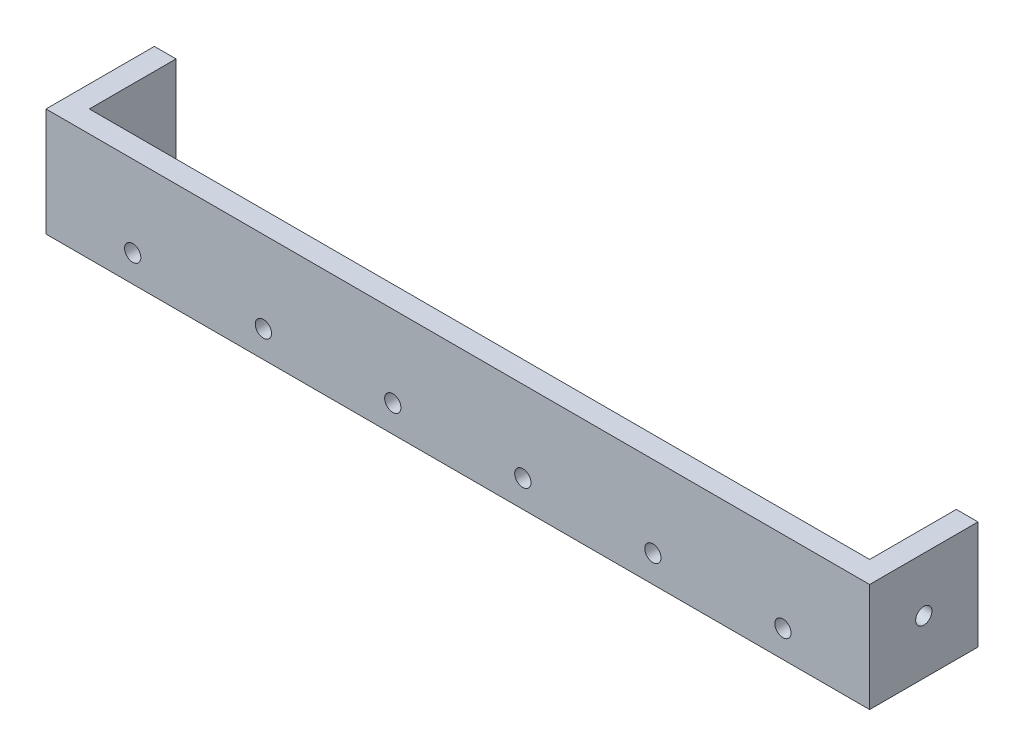
ISO-10303-21;
HEADER;
FILE_DESCRIPTION(('STEP AP214'),'2;1');
FILE_NAME('part.step','',(''),(''),'','','');
FILE_SCHEMA(('AUTOMOTIVE_DESIGN { 1 0 10303 214 1 1 1 1 }'));
ENDSEC;
DATA;
#1=APPLICATION_CONTEXT('core data for automotive mechanical design processes');
#2=APPLICATION_PROTOCOL_DEFINITION('international standard','automotive_design',2000,#1);
#3=PRODUCT_CONTEXT('',#1,'mechanical');
#4=PRODUCT('Part','Part','',(#3));
#5=PRODUCT_RELATED_PRODUCT_CATEGORY('part','',(#4));
#6=PRODUCT_DEFINITION_FORMATION('','',#4);
#7=PRODUCT_DEFINITION_CONTEXT('part definition',#1,'design');
#8=PRODUCT_DEFINITION('design','',#6,#7);
#9=PRODUCT_DEFINITION_SHAPE('','',#8);
#10=(LENGTH_UNIT() NAMED_UNIT(*) SI_UNIT(.MILLI.,.METRE.));
#11=(NAMED_UNIT(*) PLANE_ANGLE_UNIT() SI_UNIT($,.RADIAN.));
#12=(NAMED_UNIT(*) SI_UNIT($,.STERADIAN.) SOLID_ANGLE_UNIT());
#13=UNCERTAINTY_MEASURE_WITH_UNIT(LENGTH_MEASURE(1.E-05),#10,'distance_accuracy_value','');
#14=(GEOMETRIC_REPRESENTATION_CONTEXT(3) GLOBAL_UNCERTAINTY_ASSIGNED_CONTEXT((#13)) GLOBAL_UNIT_ASSIGNED_CONTEXT((#10,
#11,#12)) REPRESENTATION_CONTEXT('',''));
#15=CARTESIAN_POINT('',(0.,0.,0.));
#16=DIRECTION('',(0.,0.,1.));
#17=DIRECTION('',(1.,0.,0.));
#18=AXIS2_PLACEMENT_3D('',#15,#16,#17);
#19=CARTESIAN_POINT('',(0.,0.,2.));
#20=DIRECTION('',(0.,1.,0.));
#21=DIRECTION('',(0.,0.,1.));
#22=AXIS2_PLACEMENT_3D('',#19,#20,#21);
#23=PLANE('',#22);
#24=DIRECTION('',(1.,0.,0.));
#25=VECTOR('',#24,1.);
#26=CARTESIAN_POINT('',(0.,0.,0.));
#27=LINE('',#26,#25);
#28=CARTESIAN_POINT('',(0.,0.,0.));
#29=VERTEX_POINT('',#28);
#30=CARTESIAN_POINT('',(72.,0.,0.));
#31=VERTEX_POINT('',#30);
#32=EDGE_CURVE('E60',#29,#31,#27,.T.);
#33=ORIENTED_EDGE('',*,*,#32,.T.);
#34=DIRECTION('',(0.,0.,-1.));
#35=VECTOR('',#34,1.);
#36=CARTESIAN_POINT('',(72.,0.,2.));
#37=LINE('',#36,#35);
#38=CARTESIAN_POINT('',(72.,0.,-8.));
#39=VERTEX_POINT('',#38);
#40=EDGE_CURVE('E144',#31,#39,#37,.T.);
#41=ORIENTED_EDGE('',*,*,#40,.T.);
#42=DIRECTION('',(-1.,0.,0.));
#43=VECTOR('',#42,1.);
#44=CARTESIAN_POINT('',(74.,0.,-8.));
#45=LINE('',#44,#43);
#46=CARTESIAN_POINT('',(74.,0.,-8.));
#47=VERTEX_POINT('',#46);
#48=EDGE_CURVE('E162',#47,#39,#45,.T.);
#49=ORIENTED_EDGE('',*,*,#48,.F.);
#50=DIRECTION('',(0.,0.,-1.));
#51=VECTOR('',#50,1.);
#52=CARTESIAN_POINT('',(74.,0.,2.));
#53=LINE('',#52,#51);
#54=CARTESIAN_POINT('',(74.,0.,2.));
#55=VERTEX_POINT('',#54);
#56=EDGE_CURVE('E148',#55,#47,#53,.T.);
#57=ORIENTED_EDGE('',*,*,#56,.F.);
#58=DIRECTION('',(1.,0.,0.));
#59=VECTOR('',#58,1.);
#60=CARTESIAN_POINT('',(0.,0.,2.));
#61=LINE('',#60,#59);
#62=CARTESIAN_POINT('',(-2.,0.,2.));
#63=VERTEX_POINT('',#62);
#64=EDGE_CURVE('E45',#63,#55,#61,.T.);
#65=ORIENTED_EDGE('',*,*,#64,.F.);
#66=DIRECTION('',(0.,0.,1.));
#67=VECTOR('',#66,1.);
#68=CARTESIAN_POINT('',(-2.,0.,2.));
#69=LINE('',#68,#67);
#70=CARTESIAN_POINT('',(-2.,0.,-8.));
#71=VERTEX_POINT('',#70);
#72=EDGE_CURVE('E121',#71,#63,#69,.T.);
#73=ORIENTED_EDGE('',*,*,#72,.F.);
#74=DIRECTION('',(1.,0.,0.));
#75=VECTOR('',#74,1.);
#76=CARTESIAN_POINT('',(-2.,0.,-8.));
#77=LINE('',#76,#75);
#78=CARTESIAN_POINT('',(0.,0.,-8.));
#79=VERTEX_POINT('',#78);
#80=EDGE_CURVE('E132',#71,#79,#77,.T.);
#81=ORIENTED_EDGE('',*,*,#80,.T.);
#82=DIRECTION('',(0.,0.,1.));
#83=VECTOR('',#82,1.);
#84=CARTESIAN_POINT('',(0.,0.,2.));
#85=LINE('',#84,#83);
#86=EDGE_CURVE('E122',#79,#29,#85,.T.);
#87=ORIENTED_EDGE('',*,*,#86,.T.);
#88=EDGE_LOOP('',(#33,#41,#49,#57,#65,#73,#81,#87));
#89=FACE_BOUND('',#88,.T.);
#90=ADVANCED_FACE('F37',(#89),#23,.F.);
#91=CARTESIAN_POINT('',(0.,10.,2.));
#92=DIRECTION('',(0.,-1.,0.));
#93=DIRECTION('',(0.,0.,-1.));
#94=AXIS2_PLACEMENT_3D('',#91,#92,#93);
#95=PLANE('',#94);
#96=DIRECTION('',(-1.,0.,0.));
#97=VECTOR('',#96,1.);
#98=CARTESIAN_POINT('',(0.,10.,0.));
#99=LINE('',#98,#97);
#100=CARTESIAN_POINT('',(72.,10.,0.));
#101=VERTEX_POINT('',#100);
#102=CARTESIAN_POINT('',(0.,10.,0.));
#103=VERTEX_POINT('',#102);
#104=EDGE_CURVE('E40',#101,#103,#99,.T.);
#105=ORIENTED_EDGE('',*,*,#104,.T.);
#106=DIRECTION('',(0.,0.,-1.));
#107=VECTOR('',#106,1.);
#108=CARTESIAN_POINT('',(0.,10.,2.));
#109=LINE('',#108,#107);
#110=CARTESIAN_POINT('',(0.,10.,-8.));
#111=VERTEX_POINT('',#110);
#112=EDGE_CURVE('E133',#103,#111,#109,.T.);
#113=ORIENTED_EDGE('',*,*,#112,.T.);
#114=DIRECTION('',(1.,0.,0.));
#115=VECTOR('',#114,1.);
#116=CARTESIAN_POINT('',(-2.,10.,-8.));
#117=LINE('',#116,#115);
#118=CARTESIAN_POINT('',(-2.,10.,-8.));
#119=VERTEX_POINT('',#118);
#120=EDGE_CURVE('E113',#119,#111,#117,.T.);
#121=ORIENTED_EDGE('',*,*,#120,.F.);
#122=DIRECTION('',(0.,0.,-1.));
#123=VECTOR('',#122,1.);
#124=CARTESIAN_POINT('',(-2.,10.,2.));
#125=LINE('',#124,#123);
#126=CARTESIAN_POINT('',(-2.,10.,2.));
#127=VERTEX_POINT('',#126);
#128=EDGE_CURVE('E110',#127,#119,#125,.T.);
#129=ORIENTED_EDGE('',*,*,#128,.F.);
#130=DIRECTION('',(-1.,0.,0.));
#131=VECTOR('',#130,1.);
#132=CARTESIAN_POINT('',(0.,10.,2.));
#133=LINE('',#132,#131);
#134=CARTESIAN_POINT('',(74.,10.,2.));
#135=VERTEX_POINT('',#134);
#136=EDGE_CURVE('E11',#135,#127,#133,.T.);
#137=ORIENTED_EDGE('',*,*,#136,.F.);
#138=DIRECTION('',(0.,0.,1.));
#139=VECTOR('',#138,1.);
#140=CARTESIAN_POINT('',(74.,10.,2.));
#141=LINE('',#140,#139);
#142=CARTESIAN_POINT('',(74.,10.,-8.));
#143=VERTEX_POINT('',#142);
#144=EDGE_CURVE('E153',#143,#135,#141,.T.);
#145=ORIENTED_EDGE('',*,*,#144,.F.);
#146=DIRECTION('',(-1.,0.,0.));
#147=VECTOR('',#146,1.);
#148=CARTESIAN_POINT('',(74.,10.,-8.));
#149=LINE('',#148,#147);
#150=CARTESIAN_POINT('',(72.,10.,-8.));
#151=VERTEX_POINT('',#150);
#152=EDGE_CURVE('E155',#143,#151,#149,.T.);
#153=ORIENTED_EDGE('',*,*,#152,.T.);
#154=DIRECTION('',(0.,0.,1.));
#155=VECTOR('',#154,1.);
#156=CARTESIAN_POINT('',(72.,10.,2.));
#157=LINE('',#156,#155);
#158=EDGE_CURVE('E149',#151,#101,#157,.T.);
#159=ORIENTED_EDGE('',*,*,#158,.T.);
#160=EDGE_LOOP('',(#105,#113,#121,#129,#137,#145,#153,#159));
#161=FACE_BOUND('',#160,.T.);
#162=ADVANCED_FACE('F111',(#161),#95,.F.);
#163=CARTESIAN_POINT('',(0.,0.,2.));
#164=DIRECTION('',(0.,0.,-1.));
#165=DIRECTION('',(-1.,0.,0.));
#166=AXIS2_PLACEMENT_3D('',#163,#164,#165);
#167=PLANE('',#166);
#168=CARTESIAN_POINT('',(6.,2.5,2.));
#169=DIRECTION('',(0.,0.,1.));
#170=DIRECTION('',(1.,0.,0.));
#171=AXIS2_PLACEMENT_3D('',#168,#169,#170);
#172=CIRCLE('',#171,0.749999999999998);
#173=CARTESIAN_POINT('',(6.75,2.5,2.));
#174=VERTEX_POINT('',#173);
#175=EDGE_CURVE('E191',#174,#174,#172,.T.);
#176=ORIENTED_EDGE('',*,*,#175,.F.);
#177=EDGE_LOOP('',(#176));
#178=FACE_BOUND('',#177,.T.);
#179=CARTESIAN_POINT('',(66.,2.5,2.));
#180=DIRECTION('',(0.,0.,1.));
#181=DIRECTION('',(1.,0.,0.));
#182=AXIS2_PLACEMENT_3D('',#179,#180,#181);
#183=CIRCLE('',#182,0.749999999999999);
#184=CARTESIAN_POINT('',(66.75,2.5,2.));
#185=VERTEX_POINT('',#184);
#186=EDGE_CURVE('E185',#185,#185,#183,.T.);
#187=ORIENTED_EDGE('',*,*,#186,.F.);
#188=EDGE_LOOP('',(#187));
#189=FACE_BOUND('',#188,.T.);
#190=CARTESIAN_POINT('',(54.,2.5,2.));
#191=DIRECTION('',(0.,0.,1.));
#192=DIRECTION('',(1.,0.,0.));
#193=AXIS2_PLACEMENT_3D('',#190,#191,#192);
#194=CIRCLE('',#193,0.749999999999999);
#195=CARTESIAN_POINT('',(54.75,2.5,2.));
#196=VERTEX_POINT('',#195);
#197=EDGE_CURVE('E179',#196,#196,#194,.T.);
#198=ORIENTED_EDGE('',*,*,#197,.F.);
#199=EDGE_LOOP('',(#198));
#200=FACE_BOUND('',#199,.T.);
#201=CARTESIAN_POINT('',(18.0602404404208,2.46359958582028,2.));
#202=DIRECTION('',(0.,0.,1.));
#203=DIRECTION('',(1.,0.,0.));
#204=AXIS2_PLACEMENT_3D('',#201,#202,#203);
#205=CIRCLE('',#204,0.749999999999999);
#206=CARTESIAN_POINT('',(18.8102404404208,2.46359958582028,2.));
#207=VERTEX_POINT('',#206);
#208=EDGE_CURVE('E173',#207,#207,#205,.T.);
#209=ORIENTED_EDGE('',*,*,#208,.F.);
#210=EDGE_LOOP('',(#209));
#211=FACE_BOUND('',#210,.T.);
#212=CARTESIAN_POINT('',(30.,2.5,2.));
#213=DIRECTION('',(0.,0.,1.));
#214=DIRECTION('',(1.,0.,0.));
#215=AXIS2_PLACEMENT_3D('',#212,#213,#214);
#216=CIRCLE('',#215,0.749999999999998);
#217=CARTESIAN_POINT('',(30.75,2.5,2.));
#218=VERTEX_POINT('',#217);
#219=EDGE_CURVE('E166',#218,#218,#216,.T.);
#220=ORIENTED_EDGE('',*,*,#219,.F.);
#221=EDGE_LOOP('',(#220));
#222=FACE_BOUND('',#221,.T.);
#223=CARTESIAN_POINT('',(42.,2.5,2.));
#224=DIRECTION('',(0.,0.,1.));
#225=DIRECTION('',(1.,0.,0.));
#226=AXIS2_PLACEMENT_3D('',#223,#224,#225);
#227=CIRCLE('',#226,0.749999999999999);
#228=CARTESIAN_POINT('',(42.75,2.5,2.));
#229=VERTEX_POINT('',#228);
#230=EDGE_CURVE('E196',#229,#229,#227,.T.);
#231=ORIENTED_EDGE('',*,*,#230,.F.);
#232=EDGE_LOOP('',(#231));
#233=FACE_BOUND('',#232,.T.);
#234=ORIENTED_EDGE('',*,*,#136,.T.);
#235=DIRECTION('',(0.,1.,0.));
#236=VECTOR('',#235,1.);
#237=CARTESIAN_POINT('',(-2.,0.,2.));
#238=LINE('',#237,#236);
#239=EDGE_CURVE('E104',#63,#127,#238,.T.);
#240=ORIENTED_EDGE('',*,*,#239,.F.);
#241=ORIENTED_EDGE('',*,*,#64,.T.);
#242=DIRECTION('',(0.,-1.,0.));
#243=VECTOR('',#242,1.);
#244=CARTESIAN_POINT('',(74.,10.,2.));
#245=LINE('',#244,#243);
#246=EDGE_CURVE('E106',#135,#55,#245,.T.);
#247=ORIENTED_EDGE('',*,*,#246,.F.);
#248=EDGE_LOOP('',(#234,#240,#241,#247));
#249=FACE_BOUND('',#248,.T.);
#250=ADVANCED_FACE('F102',(#178,#189,#200,#211,#222,#233,#249),#167,.F.);
#251=CARTESIAN_POINT('',(0.,0.,0.));
#252=DIRECTION('',(0.,0.,-1.));
#253=DIRECTION('',(-1.,0.,0.));
#254=AXIS2_PLACEMENT_3D('',#251,#252,#253);
#255=PLANE('',#254);
#256=CARTESIAN_POINT('',(6.,2.5,0.));
#257=DIRECTION('',(0.,0.,1.));
#258=DIRECTION('',(1.,0.,0.));
#259=AXIS2_PLACEMENT_3D('',#256,#257,#258);
#260=CIRCLE('',#259,0.749999999999998);
#261=CARTESIAN_POINT('',(6.75,2.5,0.));
#262=VERTEX_POINT('',#261);
#263=EDGE_CURVE('E165',#262,#262,#260,.T.);
#264=ORIENTED_EDGE('',*,*,#263,.T.);
#265=EDGE_LOOP('',(#264));
#266=FACE_BOUND('',#265,.T.);
#267=CARTESIAN_POINT('',(66.,2.5,0.));
#268=DIRECTION('',(0.,0.,1.));
#269=DIRECTION('',(1.,0.,0.));
#270=AXIS2_PLACEMENT_3D('',#267,#268,#269);
#271=CIRCLE('',#270,0.749999999999999);
#272=CARTESIAN_POINT('',(66.75,2.5,0.));
#273=VERTEX_POINT('',#272);
#274=EDGE_CURVE('E188',#273,#273,#271,.T.);
#275=ORIENTED_EDGE('',*,*,#274,.T.);
#276=EDGE_LOOP('',(#275));
#277=FACE_BOUND('',#276,.T.);
#278=CARTESIAN_POINT('',(54.,2.5,0.));
#279=DIRECTION('',(0.,0.,1.));
#280=DIRECTION('',(1.,0.,0.));
#281=AXIS2_PLACEMENT_3D('',#278,#279,#280);
#282=CIRCLE('',#281,0.749999999999999);
#283=CARTESIAN_POINT('',(54.75,2.5,0.));
#284=VERTEX_POINT('',#283);
#285=EDGE_CURVE('E182',#284,#284,#282,.T.);
#286=ORIENTED_EDGE('',*,*,#285,.T.);
#287=EDGE_LOOP('',(#286));
#288=FACE_BOUND('',#287,.T.);
#289=CARTESIAN_POINT('',(18.0602404404208,2.46359958582028,0.));
#290=DIRECTION('',(0.,0.,1.));
#291=DIRECTION('',(1.,0.,0.));
#292=AXIS2_PLACEMENT_3D('',#289,#290,#291);
#293=CIRCLE('',#292,0.749999999999999);
#294=CARTESIAN_POINT('',(18.8102404404208,2.46359958582028,0.));
#295=VERTEX_POINT('',#294);
#296=EDGE_CURVE('E176',#295,#295,#293,.T.);
#297=ORIENTED_EDGE('',*,*,#296,.T.);
#298=EDGE_LOOP('',(#297));
#299=FACE_BOUND('',#298,.T.);
#300=CARTESIAN_POINT('',(30.,2.5,0.));
#301=DIRECTION('',(0.,0.,1.));
#302=DIRECTION('',(1.,0.,0.));
#303=AXIS2_PLACEMENT_3D('',#300,#301,#302);
#304=CIRCLE('',#303,0.749999999999998);
#305=CARTESIAN_POINT('',(30.75,2.5,0.));
#306=VERTEX_POINT('',#305);
#307=EDGE_CURVE('E170',#306,#306,#304,.T.);
#308=ORIENTED_EDGE('',*,*,#307,.T.);
#309=EDGE_LOOP('',(#308));
#310=FACE_BOUND('',#309,.T.);
#311=CARTESIAN_POINT('',(42.,2.5,0.));
#312=DIRECTION('',(0.,0.,1.));
#313=DIRECTION('',(1.,0.,0.));
#314=AXIS2_PLACEMENT_3D('',#311,#312,#313);
#315=CIRCLE('',#314,0.749999999999999);
#316=CARTESIAN_POINT('',(42.75,2.5,0.));
#317=VERTEX_POINT('',#316);
#318=EDGE_CURVE('E169',#317,#317,#315,.T.);
#319=ORIENTED_EDGE('',*,*,#318,.T.);
#320=EDGE_LOOP('',(#319));
#321=FACE_BOUND('',#320,.T.);
#322=DIRECTION('',(0.,-1.,0.));
#323=VECTOR('',#322,1.);
#324=CARTESIAN_POINT('',(0.,0.,0.));
#325=LINE('',#324,#323);
#326=EDGE_CURVE('E199',#103,#29,#325,.T.);
#327=ORIENTED_EDGE('',*,*,#326,.F.);
#328=ORIENTED_EDGE('',*,*,#104,.F.);
#329=DIRECTION('',(0.,1.,0.));
#330=VECTOR('',#329,1.);
#331=CARTESIAN_POINT('',(72.,0.,0.));
#332=LINE('',#331,#330);
#333=EDGE_CURVE('E205',#31,#101,#332,.T.);
#334=ORIENTED_EDGE('',*,*,#333,.F.);
#335=ORIENTED_EDGE('',*,*,#32,.F.);
#336=EDGE_LOOP('',(#327,#328,#334,#335));
#337=FACE_BOUND('',#336,.T.);
#338=ADVANCED_FACE('F242',(#266,#277,#288,#299,#310,#321,#337),#255,.T.);
#339=CARTESIAN_POINT('',(42.,2.5,2.));
#340=DIRECTION('',(0.,0.,-1.));
#341=DIRECTION('',(-1.,0.,0.));
#342=AXIS2_PLACEMENT_3D('',#339,#340,#341);
#343=CYLINDRICAL_SURFACE('',#342,0.749999999999999);
#344=ORIENTED_EDGE('',*,*,#230,.T.);
#345=EDGE_LOOP('',(#344));
#346=FACE_BOUND('',#345,.T.);
#347=ORIENTED_EDGE('',*,*,#318,.F.);
#348=EDGE_LOOP('',(#347));
#349=FACE_BOUND('',#348,.T.);
#350=ADVANCED_FACE('F247',(#346,#349),#343,.F.);
#351=CARTESIAN_POINT('',(30.,2.5,2.));
#352=DIRECTION('',(0.,0.,-1.));
#353=DIRECTION('',(-1.,0.,0.));
#354=AXIS2_PLACEMENT_3D('',#351,#352,#353);
#355=CYLINDRICAL_SURFACE('',#354,0.749999999999998);
#356=ORIENTED_EDGE('',*,*,#219,.T.);
#357=EDGE_LOOP('',(#356));
#358=FACE_BOUND('',#357,.T.);
#359=ORIENTED_EDGE('',*,*,#307,.F.);
#360=EDGE_LOOP('',(#359));
#361=FACE_BOUND('',#360,.T.);
#362=ADVANCED_FACE('F252',(#358,#361),#355,.F.);
#363=CARTESIAN_POINT('',(18.0602404404208,2.46359958582028,2.));
#364=DIRECTION('',(0.,0.,-1.));
#365=DIRECTION('',(-1.,0.,0.));
#366=AXIS2_PLACEMENT_3D('',#363,#364,#365);
#367=CYLINDRICAL_SURFACE('',#366,0.749999999999999);
#368=ORIENTED_EDGE('',*,*,#208,.T.);
#369=EDGE_LOOP('',(#368));
#370=FACE_BOUND('',#369,.T.);
#371=ORIENTED_EDGE('',*,*,#296,.F.);
#372=EDGE_LOOP('',(#371));
#373=FACE_BOUND('',#372,.T.);
#374=ADVANCED_FACE('F265',(#370,#373),#367,.F.);
#375=CARTESIAN_POINT('',(54.,2.5,2.));
#376=DIRECTION('',(0.,0.,-1.));
#377=DIRECTION('',(-1.,0.,0.));
#378=AXIS2_PLACEMENT_3D('',#375,#376,#377);
#379=CYLINDRICAL_SURFACE('',#378,0.749999999999999);
#380=ORIENTED_EDGE('',*,*,#197,.T.);
#381=EDGE_LOOP('',(#380));
#382=FACE_BOUND('',#381,.T.);
#383=ORIENTED_EDGE('',*,*,#285,.F.);
#384=EDGE_LOOP('',(#383));
#385=FACE_BOUND('',#384,.T.);
#386=ADVANCED_FACE('F261',(#382,#385),#379,.F.);
#387=CARTESIAN_POINT('',(66.,2.5,2.));
#388=DIRECTION('',(0.,0.,-1.));
#389=DIRECTION('',(-1.,0.,0.));
#390=AXIS2_PLACEMENT_3D('',#387,#388,#389);
#391=CYLINDRICAL_SURFACE('',#390,0.749999999999999);
#392=ORIENTED_EDGE('',*,*,#186,.T.);
#393=EDGE_LOOP('',(#392));
#394=FACE_BOUND('',#393,.T.);
#395=ORIENTED_EDGE('',*,*,#274,.F.);
#396=EDGE_LOOP('',(#395));
#397=FACE_BOUND('',#396,.T.);
#398=ADVANCED_FACE('F257',(#394,#397),#391,.F.);
#399=CARTESIAN_POINT('',(6.,2.5,2.));
#400=DIRECTION('',(0.,0.,-1.));
#401=DIRECTION('',(-1.,0.,0.));
#402=AXIS2_PLACEMENT_3D('',#399,#400,#401);
#403=CYLINDRICAL_SURFACE('',#402,0.749999999999998);
#404=ORIENTED_EDGE('',*,*,#175,.T.);
#405=EDGE_LOOP('',(#404));
#406=FACE_BOUND('',#405,.T.);
#407=ORIENTED_EDGE('',*,*,#263,.F.);
#408=EDGE_LOOP('',(#407));
#409=FACE_BOUND('',#408,.T.);
#410=ADVANCED_FACE('F254',(#406,#409),#403,.F.);
#411=CARTESIAN_POINT('',(72.,0.,0.));
#412=DIRECTION('',(1.,0.,0.));
#413=DIRECTION('',(0.,0.,-1.));
#414=AXIS2_PLACEMENT_3D('',#411,#412,#413);
#415=PLANE('',#414);
#416=CARTESIAN_POINT('',(72.,5.,-3.));
#417=DIRECTION('',(1.,0.,0.));
#418=DIRECTION('',(0.,0.,-1.));
#419=AXIS2_PLACEMENT_3D('',#416,#417,#418);
#420=CIRCLE('',#419,0.75);
#421=CARTESIAN_POINT('',(72.,5.,-3.75));
#422=VERTEX_POINT('',#421);
#423=EDGE_CURVE('E140',#422,#422,#420,.T.);
#424=ORIENTED_EDGE('',*,*,#423,.T.);
#425=EDGE_LOOP('',(#424));
#426=FACE_BOUND('',#425,.T.);
#427=ORIENTED_EDGE('',*,*,#40,.F.);
#428=ORIENTED_EDGE('',*,*,#333,.T.);
#429=ORIENTED_EDGE('',*,*,#158,.F.);
#430=DIRECTION('',(0.,1.,0.));
#431=VECTOR('',#430,1.);
#432=CARTESIAN_POINT('',(72.,10.,-8.));
#433=LINE('',#432,#431);
#434=EDGE_CURVE('E157',#39,#151,#433,.T.);
#435=ORIENTED_EDGE('',*,*,#434,.F.);
#436=EDGE_LOOP('',(#427,#428,#429,#435));
#437=FACE_BOUND('',#436,.T.);
#438=ADVANCED_FACE('F210',(#426,#437),#415,.F.);
#439=CARTESIAN_POINT('',(74.,10.,-8.));
#440=DIRECTION('',(0.,0.,1.));
#441=DIRECTION('',(1.,0.,0.));
#442=AXIS2_PLACEMENT_3D('',#439,#440,#441);
#443=PLANE('',#442);
#444=ORIENTED_EDGE('',*,*,#434,.T.);
#445=ORIENTED_EDGE('',*,*,#152,.F.);
#446=DIRECTION('',(0.,1.,0.));
#447=VECTOR('',#446,1.);
#448=CARTESIAN_POINT('',(74.,10.,-8.));
#449=LINE('',#448,#447);
#450=EDGE_CURVE('E151',#47,#143,#449,.T.);
#451=ORIENTED_EDGE('',*,*,#450,.F.);
#452=ORIENTED_EDGE('',*,*,#48,.T.);
#453=EDGE_LOOP('',(#444,#445,#451,#452));
#454=FACE_BOUND('',#453,.T.);
#455=ADVANCED_FACE('F216',(#454),#443,.F.);
#456=CARTESIAN_POINT('',(74.,0.,0.));
#457=DIRECTION('',(1.,0.,0.));
#458=DIRECTION('',(0.,0.,-1.));
#459=AXIS2_PLACEMENT_3D('',#456,#457,#458);
#460=PLANE('',#459);
#461=CARTESIAN_POINT('',(74.,5.,-3.));
#462=DIRECTION('',(1.,0.,0.));
#463=DIRECTION('',(0.,0.,-1.));
#464=AXIS2_PLACEMENT_3D('',#461,#462,#463);
#465=CIRCLE('',#464,0.75);
#466=CARTESIAN_POINT('',(74.,5.,-3.75));
#467=VERTEX_POINT('',#466);
#468=EDGE_CURVE('E141',#467,#467,#465,.T.);
#469=ORIENTED_EDGE('',*,*,#468,.F.);
#470=EDGE_LOOP('',(#469));
#471=FACE_BOUND('',#470,.T.);
#472=ORIENTED_EDGE('',*,*,#246,.T.);
#473=ORIENTED_EDGE('',*,*,#56,.T.);
#474=ORIENTED_EDGE('',*,*,#450,.T.);
#475=ORIENTED_EDGE('',*,*,#144,.T.);
#476=EDGE_LOOP('',(#472,#473,#474,#475));
#477=FACE_BOUND('',#476,.T.);
#478=ADVANCED_FACE('F220',(#471,#477),#460,.T.);
#479=CARTESIAN_POINT('',(74.,5.,-3.));
#480=DIRECTION('',(-1.,0.,0.));
#481=DIRECTION('',(0.,0.,1.));
#482=AXIS2_PLACEMENT_3D('',#479,#480,#481);
#483=CYLINDRICAL_SURFACE('',#482,0.75);
#484=ORIENTED_EDGE('',*,*,#468,.T.);
#485=EDGE_LOOP('',(#484));
#486=FACE_BOUND('',#485,.T.);
#487=ORIENTED_EDGE('',*,*,#423,.F.);
#488=EDGE_LOOP('',(#487));
#489=FACE_BOUND('',#488,.T.);
#490=ADVANCED_FACE('F222',(#486,#489),#483,.F.);
#491=CARTESIAN_POINT('',(0.,0.,0.));
#492=DIRECTION('',(-1.,0.,0.));
#493=DIRECTION('',(0.,0.,1.));
#494=AXIS2_PLACEMENT_3D('',#491,#492,#493);
#495=PLANE('',#494);
#496=CARTESIAN_POINT('',(0.,2.5,-3.));
#497=DIRECTION('',(-1.,0.,0.));
#498=DIRECTION('',(0.,0.,1.));
#499=AXIS2_PLACEMENT_3D('',#496,#497,#498);
#500=CIRCLE('',#499,0.75);
#501=CARTESIAN_POINT('',(0.,2.5,-2.25));
#502=VERTEX_POINT('',#501);
#503=EDGE_CURVE('E127',#502,#502,#500,.T.);
#504=ORIENTED_EDGE('',*,*,#503,.T.);
#505=EDGE_LOOP('',(#504));
#506=FACE_BOUND('',#505,.T.);
#507=ORIENTED_EDGE('',*,*,#112,.F.);
#508=ORIENTED_EDGE('',*,*,#326,.T.);
#509=ORIENTED_EDGE('',*,*,#86,.F.);
#510=DIRECTION('',(0.,-1.,0.));
#511=VECTOR('',#510,1.);
#512=CARTESIAN_POINT('',(0.,0.,-8.));
#513=LINE('',#512,#511);
#514=EDGE_CURVE('E124',#111,#79,#513,.T.);
#515=ORIENTED_EDGE('',*,*,#514,.F.);
#516=EDGE_LOOP('',(#507,#508,#509,#515));
#517=FACE_BOUND('',#516,.T.);
#518=ADVANCED_FACE('F229',(#506,#517),#495,.F.);
#519=CARTESIAN_POINT('',(-2.,0.,-8.));
#520=DIRECTION('',(0.,0.,1.));
#521=DIRECTION('',(1.,0.,0.));
#522=AXIS2_PLACEMENT_3D('',#519,#520,#521);
#523=PLANE('',#522);
#524=ORIENTED_EDGE('',*,*,#514,.T.);
#525=ORIENTED_EDGE('',*,*,#80,.F.);
#526=DIRECTION('',(0.,-1.,0.));
#527=VECTOR('',#526,1.);
#528=CARTESIAN_POINT('',(-2.,0.,-8.));
#529=LINE('',#528,#527);
#530=EDGE_CURVE('E116',#119,#71,#529,.T.);
#531=ORIENTED_EDGE('',*,*,#530,.F.);
#532=ORIENTED_EDGE('',*,*,#120,.T.);
#533=EDGE_LOOP('',(#524,#525,#531,#532));
#534=FACE_BOUND('',#533,.T.);
#535=ADVANCED_FACE('F359',(#534),#523,.F.);
#536=CARTESIAN_POINT('',(-2.,0.,0.));
#537=DIRECTION('',(-1.,0.,0.));
#538=DIRECTION('',(0.,0.,1.));
#539=AXIS2_PLACEMENT_3D('',#536,#537,#538);
#540=PLANE('',#539);
#541=CARTESIAN_POINT('',(-2.,2.5,-3.));
#542=DIRECTION('',(-1.,0.,0.));
#543=DIRECTION('',(0.,0.,1.));
#544=AXIS2_PLACEMENT_3D('',#541,#542,#543);
#545=CIRCLE('',#544,0.75);
#546=CARTESIAN_POINT('',(-2.,2.5,-2.25));
#547=VERTEX_POINT('',#546);
#548=EDGE_CURVE('E135',#547,#547,#545,.T.);
#549=ORIENTED_EDGE('',*,*,#548,.F.);
#550=EDGE_LOOP('',(#549));
#551=FACE_BOUND('',#550,.T.);
#552=ORIENTED_EDGE('',*,*,#239,.T.);
#553=ORIENTED_EDGE('',*,*,#128,.T.);
#554=ORIENTED_EDGE('',*,*,#530,.T.);
#555=ORIENTED_EDGE('',*,*,#72,.T.);
#556=EDGE_LOOP('',(#552,#553,#554,#555));
#557=FACE_BOUND('',#556,.T.);
#558=ADVANCED_FACE('F119',(#551,#557),#540,.T.);
#559=CARTESIAN_POINT('',(-2.,2.5,-3.));
#560=DIRECTION('',(1.,0.,0.));
#561=DIRECTION('',(0.,0.,-1.));
#562=AXIS2_PLACEMENT_3D('',#559,#560,#561);
#563=CYLINDRICAL_SURFACE('',#562,0.75);
#564=ORIENTED_EDGE('',*,*,#548,.T.);
#565=EDGE_LOOP('',(#564));
#566=FACE_BOUND('',#565,.T.);
#567=ORIENTED_EDGE('',*,*,#503,.F.);
#568=EDGE_LOOP('',(#567));
#569=FACE_BOUND('',#568,.T.);
#570=ADVANCED_FACE('F372',(#566,#569),#563,.F.);
#571=CLOSED_SHELL('',(#90,#162,#250,#338,#350,#362,#374,#386,#398,#410,#438,#455,#478,#490,#518,
#535,#558,#570));
#572=MANIFOLD_SOLID_BREP('B2',#571);
#573=ADVANCED_BREP_SHAPE_REPRESENTATION('',(#18,#572),#14);
#574=SHAPE_DEFINITION_REPRESENTATION(#9,#573);
ENDSEC;
END-ISO-10303-21;
